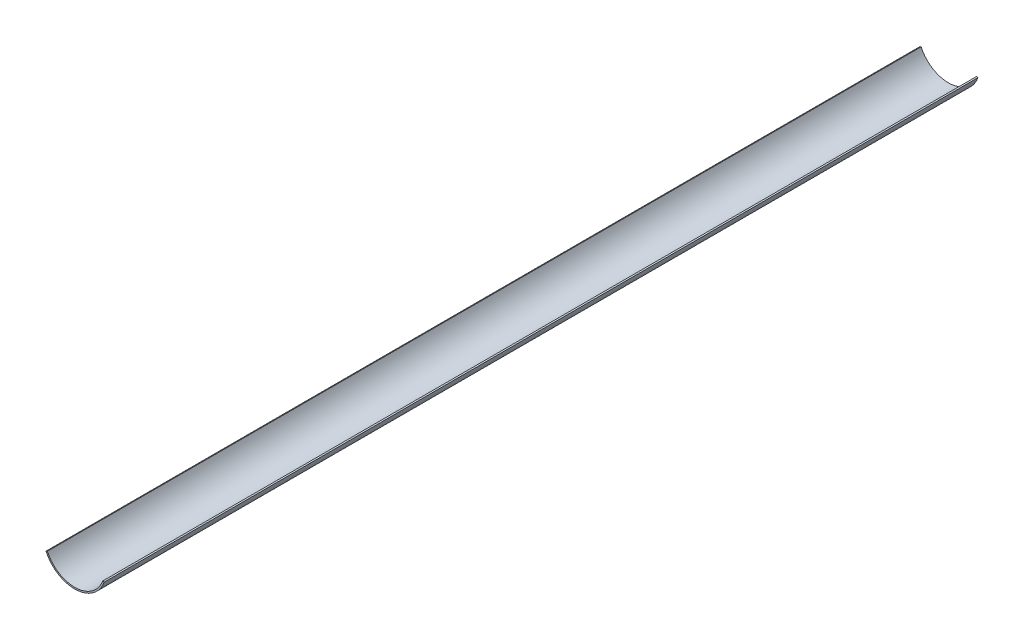
ISO-10303-21;
HEADER;
FILE_DESCRIPTION(('STEP AP214'),'2;1');
FILE_NAME('part.step','',(''),(''),'','','');
FILE_SCHEMA(('AUTOMOTIVE_DESIGN { 1 0 10303 214 1 1 1 1 }'));
ENDSEC;
DATA;
#1=APPLICATION_CONTEXT('core data for automotive mechanical design processes');
#2=APPLICATION_PROTOCOL_DEFINITION('international standard','automotive_design',2000,#1);
#3=PRODUCT_CONTEXT('',#1,'mechanical');
#4=PRODUCT('Part','Part','',(#3));
#5=PRODUCT_RELATED_PRODUCT_CATEGORY('part','',(#4));
#6=PRODUCT_DEFINITION_FORMATION('','',#4);
#7=PRODUCT_DEFINITION_CONTEXT('part definition',#1,'design');
#8=PRODUCT_DEFINITION('design','',#6,#7);
#9=PRODUCT_DEFINITION_SHAPE('','',#8);
#10=(LENGTH_UNIT() NAMED_UNIT(*) SI_UNIT(.MILLI.,.METRE.));
#11=(NAMED_UNIT(*) PLANE_ANGLE_UNIT() SI_UNIT($,.RADIAN.));
#12=(NAMED_UNIT(*) SI_UNIT($,.STERADIAN.) SOLID_ANGLE_UNIT());
#13=UNCERTAINTY_MEASURE_WITH_UNIT(LENGTH_MEASURE(1.E-05),#10,'distance_accuracy_value','');
#14=(GEOMETRIC_REPRESENTATION_CONTEXT(3) GLOBAL_UNCERTAINTY_ASSIGNED_CONTEXT((#13)) GLOBAL_UNIT_ASSIGNED_CONTEXT((#10,
#11,#12)) REPRESENTATION_CONTEXT('',''));
#15=CARTESIAN_POINT('',(0.,0.,0.));
#16=DIRECTION('',(0.,0.,1.));
#17=DIRECTION('',(1.,0.,0.));
#18=AXIS2_PLACEMENT_3D('',#15,#16,#17);
#19=CARTESIAN_POINT('',(0.,0.,175.));
#20=DIRECTION('',(0.,0.,-1.));
#21=DIRECTION('',(-1.,0.,0.));
#22=AXIS2_PLACEMENT_3D('',#19,#20,#21);
#23=CYLINDRICAL_SURFACE('',#22,6.);
#24=CARTESIAN_POINT('',(0.,0.,0.));
#25=DIRECTION('',(0.,0.,-1.));
#26=DIRECTION('',(-1.,0.,0.));
#27=AXIS2_PLACEMENT_3D('',#24,#25,#26);
#28=CIRCLE('',#27,6.);
#29=CARTESIAN_POINT('',(5.62539731045959,-2.08684093775113,0.));
#30=VERTEX_POINT('',#29);
#31=CARTESIAN_POINT('',(-5.46437276759073,-2.47802951088417,0.));
#32=VERTEX_POINT('',#31);
#33=EDGE_CURVE('E101',#30,#32,#28,.T.);
#34=ORIENTED_EDGE('',*,*,#33,.T.);
#35=DIRECTION('',(0.,0.,-1.));
#36=VECTOR('',#35,1.);
#37=CARTESIAN_POINT('',(-5.46437276759073,-2.47802951088417,175.));
#38=LINE('',#37,#36);
#39=CARTESIAN_POINT('',(-5.46437276759073,-2.47802951088417,175.));
#40=VERTEX_POINT('',#39);
#41=EDGE_CURVE('E11',#40,#32,#38,.T.);
#42=ORIENTED_EDGE('',*,*,#41,.F.);
#43=CARTESIAN_POINT('',(0.,0.,175.));
#44=DIRECTION('',(0.,0.,-1.));
#45=DIRECTION('',(-1.,0.,0.));
#46=AXIS2_PLACEMENT_3D('',#43,#44,#45);
#47=CIRCLE('',#46,6.);
#48=CARTESIAN_POINT('',(5.62539731045959,-2.08684093775113,175.));
#49=VERTEX_POINT('',#48);
#50=EDGE_CURVE('E89',#49,#40,#47,.T.);
#51=ORIENTED_EDGE('',*,*,#50,.F.);
#52=DIRECTION('',(0.,0.,-1.));
#53=VECTOR('',#52,1.);
#54=CARTESIAN_POINT('',(5.62539731045959,-2.08684093775113,175.));
#55=LINE('',#54,#53);
#56=EDGE_CURVE('E97',#49,#30,#55,.T.);
#57=ORIENTED_EDGE('',*,*,#56,.T.);
#58=EDGE_LOOP('',(#34,#42,#51,#57));
#59=FACE_BOUND('',#58,.T.);
#60=ADVANCED_FACE('F38',(#59),#23,.F.);
#61=CARTESIAN_POINT('',(-5.46437276759073,-2.47802951088417,175.));
#62=DIRECTION('',(0.394835967127678,-0.918751630780785,0.));
#63=DIRECTION('',(0.918751630780785,0.394835967127678,0.));
#64=AXIS2_PLACEMENT_3D('',#61,#62,#63);
#65=PLANE('',#64);
#66=DIRECTION('',(-0.918751630780785,-0.394835967127678,0.));
#67=VECTOR('',#66,1.);
#68=CARTESIAN_POINT('',(-5.46437276759073,-2.47802951088417,0.));
#69=LINE('',#68,#67);
#70=CARTESIAN_POINT('',(-5.73999825682497,-2.59648030102247,0.));
#71=VERTEX_POINT('',#70);
#72=EDGE_CURVE('E93',#32,#71,#69,.T.);
#73=ORIENTED_EDGE('',*,*,#72,.T.);
#74=DIRECTION('',(0.,0.,-1.));
#75=VECTOR('',#74,1.);
#76=CARTESIAN_POINT('',(-5.73999825682497,-2.59648030102247,175.));
#77=LINE('',#76,#75);
#78=CARTESIAN_POINT('',(-5.73999825682497,-2.59648030102247,175.));
#79=VERTEX_POINT('',#78);
#80=EDGE_CURVE('E46',#79,#71,#77,.T.);
#81=ORIENTED_EDGE('',*,*,#80,.F.);
#82=DIRECTION('',(-0.918751630780785,-0.394835967127678,0.));
#83=VECTOR('',#82,1.);
#84=CARTESIAN_POINT('',(-5.46437276759073,-2.47802951088417,175.));
#85=LINE('',#84,#83);
#86=EDGE_CURVE('E84',#40,#79,#85,.T.);
#87=ORIENTED_EDGE('',*,*,#86,.F.);
#88=ORIENTED_EDGE('',*,*,#41,.T.);
#89=EDGE_LOOP('',(#73,#81,#87,#88));
#90=FACE_BOUND('',#89,.T.);
#91=ADVANCED_FACE('F92',(#90),#65,.F.);
#92=CARTESIAN_POINT('',(0.,0.,175.));
#93=DIRECTION('',(0.,0.,-1.));
#94=DIRECTION('',(-1.,0.,0.));
#95=AXIS2_PLACEMENT_3D('',#92,#93,#94);
#96=CYLINDRICAL_SURFACE('',#95,6.29994364593457);
#97=CARTESIAN_POINT('',(0.,0.,0.));
#98=DIRECTION('',(0.,0.,1.));
#99=DIRECTION('',(1.,0.,0.));
#100=AXIS2_PLACEMENT_3D('',#97,#98,#99);
#101=CIRCLE('',#100,6.29994364593457);
#102=CARTESIAN_POINT('',(5.92759344799718,-2.13375862205927,0.));
#103=VERTEX_POINT('',#102);
#104=EDGE_CURVE('E71',#71,#103,#101,.T.);
#105=ORIENTED_EDGE('',*,*,#104,.T.);
#106=DIRECTION('',(0.,0.,-1.));
#107=VECTOR('',#106,1.);
#108=CARTESIAN_POINT('',(5.92759344799718,-2.13375862205927,175.));
#109=LINE('',#108,#107);
#110=CARTESIAN_POINT('',(5.92759344799718,-2.13375862205927,175.));
#111=VERTEX_POINT('',#110);
#112=EDGE_CURVE('E94',#111,#103,#109,.T.);
#113=ORIENTED_EDGE('',*,*,#112,.F.);
#114=CARTESIAN_POINT('',(0.,0.,175.));
#115=DIRECTION('',(0.,0.,1.));
#116=DIRECTION('',(1.,0.,0.));
#117=AXIS2_PLACEMENT_3D('',#114,#115,#116);
#118=CIRCLE('',#117,6.29994364593457);
#119=EDGE_CURVE('E87',#79,#111,#118,.T.);
#120=ORIENTED_EDGE('',*,*,#119,.F.);
#121=ORIENTED_EDGE('',*,*,#80,.T.);
#122=EDGE_LOOP('',(#105,#113,#120,#121));
#123=FACE_BOUND('',#122,.T.);
#124=ADVANCED_FACE('F95',(#123),#96,.T.);
#125=CARTESIAN_POINT('',(5.62539731045959,-2.08684093775113,175.));
#126=DIRECTION('',(-0.15341773099077,-0.988161423967584,0.));
#127=DIRECTION('',(0.988161423967584,-0.15341773099077,0.));
#128=AXIS2_PLACEMENT_3D('',#125,#126,#127);
#129=PLANE('',#128);
#130=DIRECTION('',(-0.988161423967584,0.15341773099077,0.));
#131=VECTOR('',#130,1.);
#132=CARTESIAN_POINT('',(5.62539731045959,-2.08684093775113,0.));
#133=LINE('',#132,#131);
#134=EDGE_CURVE('E77',#103,#30,#133,.T.);
#135=ORIENTED_EDGE('',*,*,#134,.T.);
#136=ORIENTED_EDGE('',*,*,#56,.F.);
#137=DIRECTION('',(-0.988161423967584,0.15341773099077,0.));
#138=VECTOR('',#137,1.);
#139=CARTESIAN_POINT('',(5.62539731045959,-2.08684093775113,175.));
#140=LINE('',#139,#138);
#141=EDGE_CURVE('E54',#111,#49,#140,.T.);
#142=ORIENTED_EDGE('',*,*,#141,.F.);
#143=ORIENTED_EDGE('',*,*,#112,.T.);
#144=EDGE_LOOP('',(#135,#136,#142,#143));
#145=FACE_BOUND('',#144,.T.);
#146=ADVANCED_FACE('F108',(#145),#129,.F.);
#147=CARTESIAN_POINT('',(0.,0.,175.));
#148=DIRECTION('',(0.,0.,-1.));
#149=DIRECTION('',(-1.,0.,0.));
#150=AXIS2_PLACEMENT_3D('',#147,#148,#149);
#151=PLANE('',#150);
#152=ORIENTED_EDGE('',*,*,#50,.T.);
#153=ORIENTED_EDGE('',*,*,#86,.T.);
#154=ORIENTED_EDGE('',*,*,#119,.T.);
#155=ORIENTED_EDGE('',*,*,#141,.T.);
#156=EDGE_LOOP('',(#152,#153,#154,#155));
#157=FACE_BOUND('',#156,.T.);
#158=ADVANCED_FACE('F85',(#157),#151,.F.);
#159=CARTESIAN_POINT('',(0.,0.,0.));
#160=DIRECTION('',(0.,0.,-1.));
#161=DIRECTION('',(-1.,0.,0.));
#162=AXIS2_PLACEMENT_3D('',#159,#160,#161);
#163=PLANE('',#162);
#164=ORIENTED_EDGE('',*,*,#33,.F.);
#165=ORIENTED_EDGE('',*,*,#134,.F.);
#166=ORIENTED_EDGE('',*,*,#104,.F.);
#167=ORIENTED_EDGE('',*,*,#72,.F.);
#168=EDGE_LOOP('',(#164,#165,#166,#167));
#169=FACE_BOUND('',#168,.T.);
#170=ADVANCED_FACE('F111',(#169),#163,.T.);
#171=CLOSED_SHELL('',(#60,#91,#124,#146,#158,#170));
#172=MANIFOLD_SOLID_BREP('B2',#171);
#173=ADVANCED_BREP_SHAPE_REPRESENTATION('',(#18,#172),#14);
#174=SHAPE_DEFINITION_REPRESENTATION(#9,#173);
ENDSEC;
END-ISO-10303-21;
